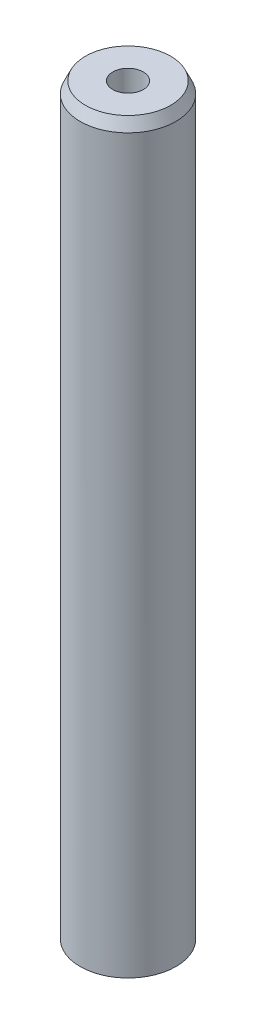
ISO-10303-21;
HEADER;
FILE_DESCRIPTION(('STEP AP214'),'2;1');
FILE_NAME('part.step','',(''),(''),'','','');
FILE_SCHEMA(('AUTOMOTIVE_DESIGN { 1 0 10303 214 1 1 1 1 }'));
ENDSEC;
DATA;
#1=APPLICATION_CONTEXT('core data for automotive mechanical design processes');
#2=APPLICATION_PROTOCOL_DEFINITION('international standard','automotive_design',2000,#1);
#3=PRODUCT_CONTEXT('',#1,'mechanical');
#4=PRODUCT('Part','Part','',(#3));
#5=PRODUCT_RELATED_PRODUCT_CATEGORY('part','',(#4));
#6=PRODUCT_DEFINITION_FORMATION('','',#4);
#7=PRODUCT_DEFINITION_CONTEXT('part definition',#1,'design');
#8=PRODUCT_DEFINITION('design','',#6,#7);
#9=PRODUCT_DEFINITION_SHAPE('','',#8);
#10=(LENGTH_UNIT() NAMED_UNIT(*) SI_UNIT(.MILLI.,.METRE.));
#11=(NAMED_UNIT(*) PLANE_ANGLE_UNIT() SI_UNIT($,.RADIAN.));
#12=(NAMED_UNIT(*) SI_UNIT($,.STERADIAN.) SOLID_ANGLE_UNIT());
#13=UNCERTAINTY_MEASURE_WITH_UNIT(LENGTH_MEASURE(1.E-05),#10,'distance_accuracy_value','');
#14=(GEOMETRIC_REPRESENTATION_CONTEXT(3) GLOBAL_UNCERTAINTY_ASSIGNED_CONTEXT((#13)) GLOBAL_UNIT_ASSIGNED_CONTEXT((#10,
#11,#12)) REPRESENTATION_CONTEXT('',''));
#15=CARTESIAN_POINT('',(0.,0.,0.));
#16=DIRECTION('',(0.,0.,1.));
#17=DIRECTION('',(1.,0.,0.));
#18=AXIS2_PLACEMENT_3D('',#15,#16,#17);
#19=CARTESIAN_POINT('',(0.,195.28222241796,0.));
#20=DIRECTION('',(0.,-1.,0.));
#21=DIRECTION('',(0.,0.,-1.));
#22=AXIS2_PLACEMENT_3D('',#19,#20,#21);
#23=CYLINDRICAL_SURFACE('',#22,12.5);
#24=CARTESIAN_POINT('',(0.,192.333828740495,0.));
#25=DIRECTION('',(0.,1.,0.));
#26=DIRECTION('',(0.,0.,1.));
#27=AXIS2_PLACEMENT_3D('',#24,#25,#26);
#28=CIRCLE('',#27,12.5);
#29=CARTESIAN_POINT('',(0.,192.333828740495,-12.5));
#30=VERTEX_POINT('',#29);
#31=EDGE_CURVE('E50',#30,#30,#28,.F.);
#32=ORIENTED_EDGE('',*,*,#31,.T.);
#33=EDGE_LOOP('',(#32));
#34=FACE_BOUND('',#33,.T.);
#35=CARTESIAN_POINT('',(0.,1.38650723772624,0.));
#36=DIRECTION('',(0.,1.,0.));
#37=DIRECTION('',(0.,0.,1.));
#38=AXIS2_PLACEMENT_3D('',#35,#36,#37);
#39=CIRCLE('',#38,12.5);
#40=CARTESIAN_POINT('',(0.,1.38650723772624,12.5));
#41=VERTEX_POINT('',#40);
#42=EDGE_CURVE('E51',#41,#41,#39,.T.);
#43=ORIENTED_EDGE('',*,*,#42,.T.);
#44=EDGE_LOOP('',(#43));
#45=FACE_BOUND('',#44,.T.);
#46=ADVANCED_FACE('F39',(#34,#45),#23,.T.);
#47=CARTESIAN_POINT('',(0.,195.28222241796,0.));
#48=DIRECTION('',(0.,1.,0.));
#49=DIRECTION('',(0.,0.,1.));
#50=AXIS2_PLACEMENT_3D('',#47,#48,#49);
#51=PLANE('',#50);
#52=CARTESIAN_POINT('',(0.,195.28222241796,0.));
#53=DIRECTION('',(0.,1.,0.));
#54=DIRECTION('',(0.,0.,1.));
#55=AXIS2_PLACEMENT_3D('',#52,#53,#54);
#56=CIRCLE('',#55,11.1134927622738);
#57=CARTESIAN_POINT('',(0.,195.28222241796,-11.1134927622738));
#58=VERTEX_POINT('',#57);
#59=EDGE_CURVE('E54',#58,#58,#56,.T.);
#60=ORIENTED_EDGE('',*,*,#59,.T.);
#61=EDGE_LOOP('',(#60));
#62=FACE_BOUND('',#61,.T.);
#63=CARTESIAN_POINT('',(0.,195.28222241796,0.));
#64=DIRECTION('',(0.,1.,0.));
#65=DIRECTION('',(0.,0.,1.));
#66=AXIS2_PLACEMENT_3D('',#63,#64,#65);
#67=CIRCLE('',#66,3.98482293029033);
#68=CARTESIAN_POINT('',(0.,195.28222241796,3.98482293029033));
#69=VERTEX_POINT('',#68);
#70=EDGE_CURVE('E58',#69,#69,#67,.T.);
#71=ORIENTED_EDGE('',*,*,#70,.F.);
#72=EDGE_LOOP('',(#71));
#73=FACE_BOUND('',#72,.T.);
#74=ADVANCED_FACE('F69',(#62,#73),#51,.T.);
#75=CARTESIAN_POINT('',(0.,0.,0.));
#76=DIRECTION('',(0.,1.,0.));
#77=DIRECTION('',(0.,0.,1.));
#78=AXIS2_PLACEMENT_3D('',#75,#76,#77);
#79=PLANE('',#78);
#80=CARTESIAN_POINT('',(0.,0.,0.));
#81=DIRECTION('',(0.,1.,0.));
#82=DIRECTION('',(0.,0.,1.));
#83=AXIS2_PLACEMENT_3D('',#80,#81,#82);
#84=CIRCLE('',#83,9.55160632253507);
#85=CARTESIAN_POINT('',(0.,0.,9.55160632253507));
#86=VERTEX_POINT('',#85);
#87=EDGE_CURVE('E10',#86,#86,#84,.F.);
#88=ORIENTED_EDGE('',*,*,#87,.T.);
#89=EDGE_LOOP('',(#88));
#90=FACE_BOUND('',#89,.T.);
#91=CARTESIAN_POINT('',(0.,0.,0.));
#92=DIRECTION('',(0.,1.,0.));
#93=DIRECTION('',(0.,0.,1.));
#94=AXIS2_PLACEMENT_3D('',#91,#92,#93);
#95=CIRCLE('',#94,3.98482293029033);
#96=CARTESIAN_POINT('',(0.,0.,3.98482293029033));
#97=VERTEX_POINT('',#96);
#98=EDGE_CURVE('E63',#97,#97,#95,.T.);
#99=ORIENTED_EDGE('',*,*,#98,.T.);
#100=EDGE_LOOP('',(#99));
#101=FACE_BOUND('',#100,.T.);
#102=ADVANCED_FACE('F75',(#90,#101),#79,.F.);
#103=CARTESIAN_POINT('',(0.,195.28222241796,0.));
#104=DIRECTION('',(0.,-1.,0.));
#105=DIRECTION('',(0.,0.,-1.));
#106=AXIS2_PLACEMENT_3D('',#103,#104,#105);
#107=CYLINDRICAL_SURFACE('',#106,3.98482293029033);
#108=ORIENTED_EDGE('',*,*,#70,.T.);
#109=EDGE_LOOP('',(#108));
#110=FACE_BOUND('',#109,.T.);
#111=ORIENTED_EDGE('',*,*,#98,.F.);
#112=EDGE_LOOP('',(#111));
#113=FACE_BOUND('',#112,.T.);
#114=ADVANCED_FACE('F70',(#110,#113),#107,.F.);
#115=CARTESIAN_POINT('',(0.,195.28222241796,0.));
#116=DIRECTION('',(0.,-1.,0.));
#117=DIRECTION('',(0.,0.,-1.));
#118=AXIS2_PLACEMENT_3D('',#115,#116,#117);
#119=CONICAL_SURFACE('',#118,11.1134927622738,0.439572609029045);
#120=CARTESIAN_POINT('',(0.,192.333828740495,-12.5));
#121=CARTESIAN_POINT('',(0.,192.364541174635,-12.4855572162737));
#122=CARTESIAN_POINT('',(0.,192.395253608776,-12.4711144325474));
#123=CARTESIAN_POINT('',(0.,192.456678477056,-12.4422288650947));
#124=CARTESIAN_POINT('',(0.,192.487390911196,-12.4277860813684));
#125=CARTESIAN_POINT('',(0.,192.548815779477,-12.3989005139158));
#126=CARTESIAN_POINT('',(0.,192.579528213617,-12.3844577301895));
#127=CARTESIAN_POINT('',(0.,192.640953081898,-12.3555721627369));
#128=CARTESIAN_POINT('',(0.,192.671665516038,-12.3411293790105));
#129=CARTESIAN_POINT('',(0.,192.733090384319,-12.3122438115579));
#130=CARTESIAN_POINT('',(0.,192.763802818459,-12.2978010278316));
#131=CARTESIAN_POINT('',(0.,192.825227686739,-12.268915460379));
#132=CARTESIAN_POINT('',(0.,192.85594012088,-12.2544726766527));
#133=CARTESIAN_POINT('',(0.,192.91736498916,-12.2255871092));
#134=CARTESIAN_POINT('',(0.,192.9480774233,-12.2111443254737));
#135=CARTESIAN_POINT('',(0.,193.009502291581,-12.1822587580211));
#136=CARTESIAN_POINT('',(0.,193.040214725721,-12.1678159742948));
#137=CARTESIAN_POINT('',(0.,193.101639594002,-12.1389304068421));
#138=CARTESIAN_POINT('',(0.,193.132352028142,-12.1244876231158));
#139=CARTESIAN_POINT('',(0.,193.193776896422,-12.0956020556632));
#140=CARTESIAN_POINT('',(0.,193.224489330563,-12.0811592719369));
#141=CARTESIAN_POINT('',(0.,193.285914198843,-12.0522737044842));
#142=CARTESIAN_POINT('',(0.,193.316626632983,-12.0378309207579));
#143=CARTESIAN_POINT('',(0.,193.378051501264,-12.0089453533053));
#144=CARTESIAN_POINT('',(0.,193.408763935404,-11.994502569579));
#145=CARTESIAN_POINT('',(0.,193.470188803685,-11.9656170021264));
#146=CARTESIAN_POINT('',(0.,193.500901237825,-11.9511742184));
#147=CARTESIAN_POINT('',(0.,193.562326106106,-11.9222886509474));
#148=CARTESIAN_POINT('',(0.,193.593038540246,-11.9078458672211));
#149=CARTESIAN_POINT('',(0.,193.654463408526,-11.8789602997685));
#150=CARTESIAN_POINT('',(0.,193.685175842667,-11.8645175160421));
#151=CARTESIAN_POINT('',(0.,193.746600710947,-11.8356319485895));
#152=CARTESIAN_POINT('',(0.,193.777313145087,-11.8211891648632));
#153=CARTESIAN_POINT('',(0.,193.838738013368,-11.7923035974106));
#154=CARTESIAN_POINT('',(0.,193.869450447508,-11.7778608136843));
#155=CARTESIAN_POINT('',(0.,193.930875315789,-11.7489752462316));
#156=CARTESIAN_POINT('',(0.,193.961587749929,-11.7345324625053));
#157=CARTESIAN_POINT('',(0.,194.023012618209,-11.7056468950527));
#158=CARTESIAN_POINT('',(0.,194.05372505235,-11.6912041113264));
#159=CARTESIAN_POINT('',(0.,194.11514992063,-11.6623185438737));
#160=CARTESIAN_POINT('',(0.,194.14586235477,-11.6478757601474));
#161=CARTESIAN_POINT('',(0.,194.207287223051,-11.6189901926948));
#162=CARTESIAN_POINT('',(0.,194.237999657191,-11.6045474089685));
#163=CARTESIAN_POINT('',(0.,194.299424525472,-11.5756618415158));
#164=CARTESIAN_POINT('',(0.,194.330136959612,-11.5612190577895));
#165=CARTESIAN_POINT('',(0.,194.391561827893,-11.5323334903369));
#166=CARTESIAN_POINT('',(0.,194.422274262033,-11.5178907066106));
#167=CARTESIAN_POINT('',(0.,194.483699130313,-11.489005139158));
#168=CARTESIAN_POINT('',(0.,194.514411564454,-11.4745623554316));
#169=CARTESIAN_POINT('',(0.,194.575836432734,-11.445676787979));
#170=CARTESIAN_POINT('',(0.,194.606548866874,-11.4312340042527));
#171=CARTESIAN_POINT('',(0.,194.667973735155,-11.4023484368001));
#172=CARTESIAN_POINT('',(0.,194.698686169295,-11.3879056530738));
#173=CARTESIAN_POINT('',(0.,194.760111037576,-11.3590200856211));
#174=CARTESIAN_POINT('',(0.,194.790823471716,-11.3445773018948));
#175=CARTESIAN_POINT('',(0.,194.852248339996,-11.3156917344422));
#176=CARTESIAN_POINT('',(0.,194.882960774137,-11.3012489507159));
#177=CARTESIAN_POINT('',(0.,194.944385642417,-11.2723633832632));
#178=CARTESIAN_POINT('',(0.,194.975098076557,-11.2579205995369));
#179=CARTESIAN_POINT('',(0.,195.036522944838,-11.2290350320843));
#180=CARTESIAN_POINT('',(0.,195.067235378978,-11.214592248358));
#181=CARTESIAN_POINT('',(0.,195.128660247259,-11.1857066809053));
#182=CARTESIAN_POINT('',(0.,195.159372681399,-11.171263897179));
#183=CARTESIAN_POINT('',(0.,195.22079754968,-11.1423783297264));
#184=CARTESIAN_POINT('',(0.,195.25150998382,-11.1279355460001));
#185=CARTESIAN_POINT('',(0.,195.28222241796,-11.1134927622738));
#186=B_SPLINE_CURVE_WITH_KNOTS('',3,(#120,#121,#122,#123,#124,#125,#126,#127,#128,#129,#130,
#131,#132,#133,#134,#135,#136,#137,#138,#139,#140,#141,#142,#143,#144,#145,#146,#147,#148,#149,
#150,#151,#152,#153,#154,#155,#156,#157,#158,#159,#160,#161,#162,#163,#164,#165,#166,#167,#168,
#169,#170,#171,#172,#173,#174,#175,#176,#177,#178,#179,#180,#181,#182,#183,#184,#185),
.UNSPECIFIED.,.F.,.F.,(4,2,2,2,2,2,2,2,2,2,2,2,2,2,2,2,2,2,2,2,2,2,2,2,2,2,2,2,2,2,2,2,4),(0.,
0.101816641632217,0.203633283264434,0.305449924896652,0.407266566528868,0.509083208161086,
0.610899849793303,0.712716491425545,0.814533133057763,0.916349774689979,1.0181664163222,
1.11998305795441,1.22179969958663,1.32361634121887,1.42543298285109,1.52724962448331,
1.62906626611552,1.73088290774774,1.83269954937996,1.93451619101218,2.03633283264442,
2.13814947427664,2.23996611590885,2.34178275754107,2.44359939917329,2.5454160408055,
2.64723268243775,2.74904932406996,2.85086596570218,2.9526826073344,3.05449924896662,
3.15631589059883,3.25813253223108),.UNSPECIFIED.);
#187=EDGE_CURVE('BSEAM81',#30,#58,#186,.T.);
#188=ORIENTED_EDGE('',*,*,#31,.F.);
#189=ORIENTED_EDGE('',*,*,#59,.F.);
#190=ORIENTED_EDGE('',*,*,#187,.T.);
#191=ORIENTED_EDGE('',*,*,#187,.F.);
#192=EDGE_LOOP('',(#188,#190,#189,#191));
#193=FACE_BOUND('',#192,.T.);
#194=ADVANCED_FACE('F81',(#193),#119,.T.);
#195=CARTESIAN_POINT('',(0.,1.38650723772624,0.));
#196=DIRECTION('',(0.,1.,0.));
#197=DIRECTION('',(0.,0.,1.));
#198=AXIS2_PLACEMENT_3D('',#195,#196,#197);
#199=CONICAL_SURFACE('',#198,12.5,1.13122371776585);
#200=ORIENTED_EDGE('',*,*,#87,.F.);
#201=EDGE_LOOP('',(#200));
#202=FACE_BOUND('',#201,.T.);
#203=ORIENTED_EDGE('',*,*,#42,.F.);
#204=EDGE_LOOP('',(#203));
#205=FACE_BOUND('',#204,.T.);
#206=ADVANCED_FACE('F45',(#202,#205),#199,.T.);
#207=CLOSED_SHELL('',(#46,#74,#102,#114,#194,#206));
#208=MANIFOLD_SOLID_BREP('B2',#207);
#209=ADVANCED_BREP_SHAPE_REPRESENTATION('',(#18,#208),#14);
#210=SHAPE_DEFINITION_REPRESENTATION(#9,#209);
ENDSEC;
END-ISO-10303-21;
